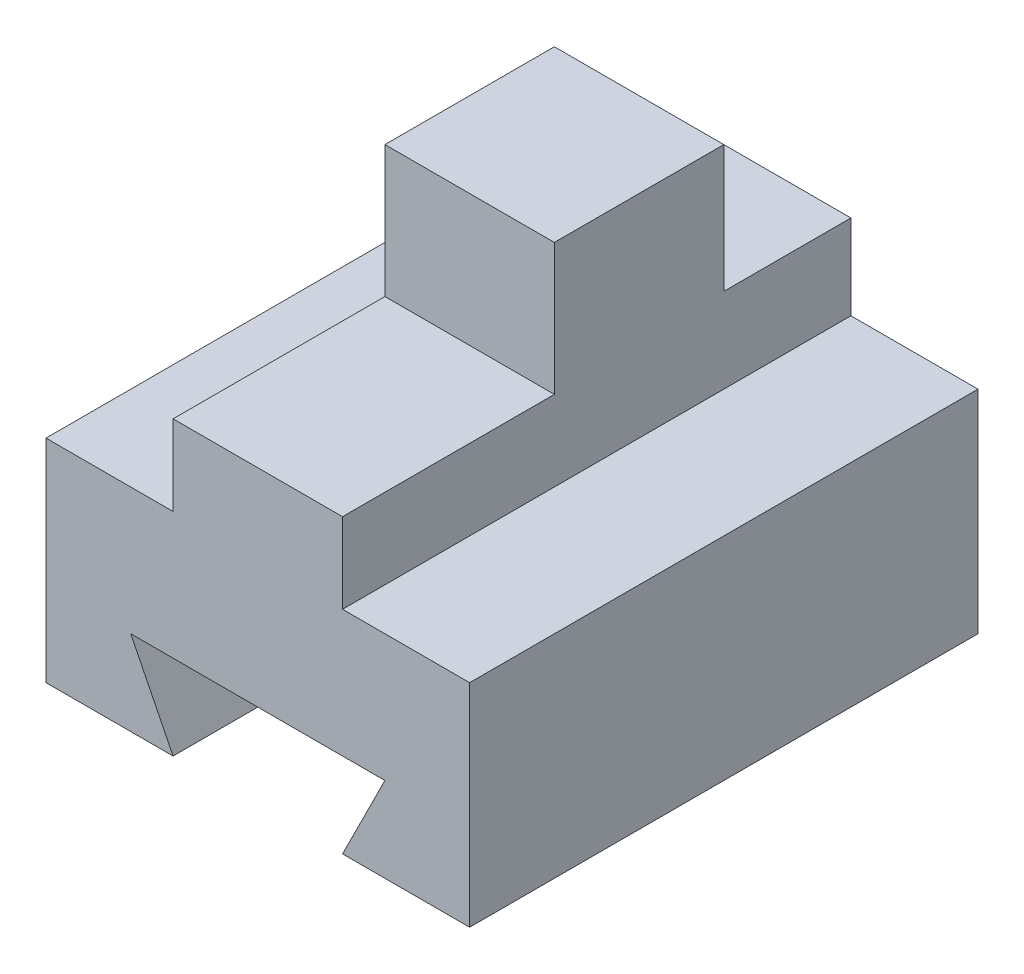
ISO-10303-21;
HEADER;
FILE_DESCRIPTION(('STEP AP214'),'2;1');
FILE_NAME('part.step','',(''),(''),'','','');
FILE_SCHEMA(('AUTOMOTIVE_DESIGN { 1 0 10303 214 1 1 1 1 }'));
ENDSEC;
DATA;
#1=APPLICATION_CONTEXT('core data for automotive mechanical design processes');
#2=APPLICATION_PROTOCOL_DEFINITION('international standard','automotive_design',2000,#1);
#3=PRODUCT_CONTEXT('',#1,'mechanical');
#4=PRODUCT('Part','Part','',(#3));
#5=PRODUCT_RELATED_PRODUCT_CATEGORY('part','',(#4));
#6=PRODUCT_DEFINITION_FORMATION('','',#4);
#7=PRODUCT_DEFINITION_CONTEXT('part definition',#1,'design');
#8=PRODUCT_DEFINITION('design','',#6,#7);
#9=PRODUCT_DEFINITION_SHAPE('','',#8);
#10=(LENGTH_UNIT() NAMED_UNIT(*) SI_UNIT(.MILLI.,.METRE.));
#11=(NAMED_UNIT(*) PLANE_ANGLE_UNIT() SI_UNIT($,.RADIAN.));
#12=(NAMED_UNIT(*) SI_UNIT($,.STERADIAN.) SOLID_ANGLE_UNIT());
#13=UNCERTAINTY_MEASURE_WITH_UNIT(LENGTH_MEASURE(1.E-05),#10,'distance_accuracy_value','');
#14=(GEOMETRIC_REPRESENTATION_CONTEXT(3) GLOBAL_UNCERTAINTY_ASSIGNED_CONTEXT((#13)) GLOBAL_UNIT_ASSIGNED_CONTEXT((#10,
#11,#12)) REPRESENTATION_CONTEXT('',''));
#15=CARTESIAN_POINT('',(0.,0.,0.));
#16=DIRECTION('',(0.,0.,1.));
#17=DIRECTION('',(1.,0.,0.));
#18=AXIS2_PLACEMENT_3D('',#15,#16,#17);
#19=CARTESIAN_POINT('',(-38.1029706753271,-27.6315789473684,60.));
#20=DIRECTION('',(0.,1.,0.));
#21=DIRECTION('',(0.,0.,1.));
#22=AXIS2_PLACEMENT_3D('',#19,#20,#21);
#23=PLANE('',#22);
#24=DIRECTION('',(1.,0.,0.));
#25=VECTOR('',#24,1.);
#26=CARTESIAN_POINT('',(-38.1029706753271,-27.6315789473684,0.));
#27=LINE('',#26,#25);
#28=CARTESIAN_POINT('',(-38.1029706753271,-27.6315789473684,0.));
#29=VERTEX_POINT('',#28);
#30=CARTESIAN_POINT('',(-23.1029706753271,-27.6315789473684,0.));
#31=VERTEX_POINT('',#30);
#32=EDGE_CURVE('E220',#29,#31,#27,.T.);
#33=ORIENTED_EDGE('',*,*,#32,.T.);
#34=DIRECTION('',(0.,0.,1.));
#35=VECTOR('',#34,1.);
#36=CARTESIAN_POINT('',(-23.1029706753271,-27.6315789473684,0.));
#37=LINE('',#36,#35);
#38=CARTESIAN_POINT('',(-23.1029706753271,-27.6315789473684,60.));
#39=VERTEX_POINT('',#38);
#40=EDGE_CURVE('E191',#31,#39,#37,.T.);
#41=ORIENTED_EDGE('',*,*,#40,.T.);
#42=DIRECTION('',(1.,0.,0.));
#43=VECTOR('',#42,1.);
#44=CARTESIAN_POINT('',(-38.1029706753271,-27.6315789473684,60.));
#45=LINE('',#44,#43);
#46=CARTESIAN_POINT('',(-38.1029706753271,-27.6315789473684,60.));
#47=VERTEX_POINT('',#46);
#48=EDGE_CURVE('E212',#47,#39,#45,.T.);
#49=ORIENTED_EDGE('',*,*,#48,.F.);
#50=DIRECTION('',(0.,0.,-1.));
#51=VECTOR('',#50,1.);
#52=CARTESIAN_POINT('',(-38.1029706753271,-27.6315789473684,60.));
#53=LINE('',#52,#51);
#54=EDGE_CURVE('E11',#47,#29,#53,.T.);
#55=ORIENTED_EDGE('',*,*,#54,.T.);
#56=EDGE_LOOP('',(#33,#41,#49,#55));
#57=FACE_BOUND('',#56,.T.);
#58=ADVANCED_FACE('F33',(#57),#23,.F.);
#59=CARTESIAN_POINT('',(-38.1029706753271,22.3684210526316,60.));
#60=DIRECTION('',(1.,0.,0.));
#61=DIRECTION('',(0.,0.,-1.));
#62=AXIS2_PLACEMENT_3D('',#59,#60,#61);
#63=PLANE('',#62);
#64=DIRECTION('',(0.,-1.,0.));
#65=VECTOR('',#64,1.);
#66=CARTESIAN_POINT('',(-38.1029706753271,22.3684210526316,60.));
#67=LINE('',#66,#65);
#68=CARTESIAN_POINT('',(-38.1029706753271,-2.63157894736843,60.));
#69=VERTEX_POINT('',#68);
#70=EDGE_CURVE('E208',#69,#47,#67,.T.);
#71=ORIENTED_EDGE('',*,*,#70,.F.);
#72=DIRECTION('',(0.,0.,1.));
#73=VECTOR('',#72,1.);
#74=CARTESIAN_POINT('',(-38.1029706753271,-2.63157894736843,0.));
#75=LINE('',#74,#73);
#76=CARTESIAN_POINT('',(-38.1029706753271,-2.63157894736843,0.));
#77=VERTEX_POINT('',#76);
#78=EDGE_CURVE('E278',#77,#69,#75,.T.);
#79=ORIENTED_EDGE('',*,*,#78,.F.);
#80=DIRECTION('',(0.,-1.,0.));
#81=VECTOR('',#80,1.);
#82=CARTESIAN_POINT('',(-38.1029706753271,22.3684210526316,0.));
#83=LINE('',#82,#81);
#84=EDGE_CURVE('E201',#77,#29,#83,.T.);
#85=ORIENTED_EDGE('',*,*,#84,.T.);
#86=ORIENTED_EDGE('',*,*,#54,.F.);
#87=EDGE_LOOP('',(#71,#79,#85,#86));
#88=FACE_BOUND('',#87,.T.);
#89=ADVANCED_FACE('F35',(#88),#63,.F.);
#90=CARTESIAN_POINT('',(-3.10297067532714,-27.6315789473684,60.));
#91=VERTEX_POINT('',#90);
#92=CARTESIAN_POINT('',(11.8970293246729,-27.6315789473684,60.));
#93=VERTEX_POINT('',#92);
#94=EDGE_CURVE('E210',#91,#93,#45,.T.);
#95=ORIENTED_EDGE('',*,*,#94,.F.);
#96=DIRECTION('',(0.,0.,1.));
#97=VECTOR('',#96,1.);
#98=CARTESIAN_POINT('',(-3.10297067532714,-27.6315789473684,0.));
#99=LINE('',#98,#97);
#100=CARTESIAN_POINT('',(-3.10297067532714,-27.6315789473684,0.));
#101=VERTEX_POINT('',#100);
#102=EDGE_CURVE('E204',#101,#91,#99,.T.);
#103=ORIENTED_EDGE('',*,*,#102,.F.);
#104=CARTESIAN_POINT('',(11.8970293246729,-27.6315789473684,0.));
#105=VERTEX_POINT('',#104);
#106=EDGE_CURVE('E219',#101,#105,#27,.T.);
#107=ORIENTED_EDGE('',*,*,#106,.T.);
#108=DIRECTION('',(0.,0.,-1.));
#109=VECTOR('',#108,1.);
#110=CARTESIAN_POINT('',(11.8970293246729,-27.6315789473684,60.));
#111=LINE('',#110,#109);
#112=EDGE_CURVE('E41',#93,#105,#111,.T.);
#113=ORIENTED_EDGE('',*,*,#112,.F.);
#114=EDGE_LOOP('',(#95,#103,#107,#113));
#115=FACE_BOUND('',#114,.T.);
#116=ADVANCED_FACE('F257',(#115),#23,.F.);
#117=CARTESIAN_POINT('',(11.8970293246729,22.3684210526316,60.));
#118=DIRECTION('',(-1.,0.,0.));
#119=DIRECTION('',(0.,0.,1.));
#120=AXIS2_PLACEMENT_3D('',#117,#118,#119);
#121=PLANE('',#120);
#122=DIRECTION('',(0.,1.,0.));
#123=VECTOR('',#122,1.);
#124=CARTESIAN_POINT('',(11.8970293246729,22.3684210526316,0.));
#125=LINE('',#124,#123);
#126=CARTESIAN_POINT('',(11.8970293246729,-2.63157894736843,0.));
#127=VERTEX_POINT('',#126);
#128=EDGE_CURVE('E211',#105,#127,#125,.T.);
#129=ORIENTED_EDGE('',*,*,#128,.T.);
#130=DIRECTION('',(0.,0.,1.));
#131=VECTOR('',#130,1.);
#132=CARTESIAN_POINT('',(11.8970293246729,-2.63157894736843,0.));
#133=LINE('',#132,#131);
#134=CARTESIAN_POINT('',(11.8970293246729,-2.63157894736843,60.));
#135=VERTEX_POINT('',#134);
#136=EDGE_CURVE('E174',#127,#135,#133,.T.);
#137=ORIENTED_EDGE('',*,*,#136,.T.);
#138=DIRECTION('',(0.,1.,0.));
#139=VECTOR('',#138,1.);
#140=CARTESIAN_POINT('',(11.8970293246729,22.3684210526316,60.));
#141=LINE('',#140,#139);
#142=EDGE_CURVE('E215',#93,#135,#141,.T.);
#143=ORIENTED_EDGE('',*,*,#142,.F.);
#144=ORIENTED_EDGE('',*,*,#112,.T.);
#145=EDGE_LOOP('',(#129,#137,#143,#144));
#146=FACE_BOUND('',#145,.T.);
#147=ADVANCED_FACE('F229',(#146),#121,.F.);
#148=CARTESIAN_POINT('',(-38.1029706753271,22.3684210526316,60.));
#149=DIRECTION('',(0.,-1.,0.));
#150=DIRECTION('',(1.,0.,0.));
#151=AXIS2_PLACEMENT_3D('',#148,#149,#150);
#152=PLANE('',#151);
#153=DIRECTION('',(0.,0.,1.));
#154=VECTOR('',#153,1.);
#155=CARTESIAN_POINT('',(-23.1029706753271,22.3684210526316,0.));
#156=LINE('',#155,#154);
#157=CARTESIAN_POINT('',(-23.1029706753271,22.3684210526316,15.));
#158=VERTEX_POINT('',#157);
#159=CARTESIAN_POINT('',(-23.1029706753271,22.3684210526316,35.));
#160=VERTEX_POINT('',#159);
#161=EDGE_CURVE('E163',#158,#160,#156,.T.);
#162=ORIENTED_EDGE('',*,*,#161,.T.);
#163=DIRECTION('',(-1.,0.,0.));
#164=VECTOR('',#163,1.);
#165=CARTESIAN_POINT('',(-3.10297067532715,22.3684210526316,35.));
#166=LINE('',#165,#164);
#167=CARTESIAN_POINT('',(-3.10297067532715,22.3684210526316,35.));
#168=VERTEX_POINT('',#167);
#169=EDGE_CURVE('E48',#168,#160,#166,.T.);
#170=ORIENTED_EDGE('',*,*,#169,.F.);
#171=DIRECTION('',(0.,0.,1.));
#172=VECTOR('',#171,1.);
#173=CARTESIAN_POINT('',(-3.10297067532714,22.3684210526316,0.));
#174=LINE('',#173,#172);
#175=CARTESIAN_POINT('',(-3.10297067532715,22.3684210526316,15.));
#176=VERTEX_POINT('',#175);
#177=EDGE_CURVE('E161',#176,#168,#174,.T.);
#178=ORIENTED_EDGE('',*,*,#177,.F.);
#179=DIRECTION('',(-1.,0.,0.));
#180=VECTOR('',#179,1.);
#181=CARTESIAN_POINT('',(-3.10297067532715,22.3684210526316,15.));
#182=LINE('',#181,#180);
#183=EDGE_CURVE('E293',#176,#158,#182,.T.);
#184=ORIENTED_EDGE('',*,*,#183,.T.);
#185=EDGE_LOOP('',(#162,#170,#178,#184));
#186=FACE_BOUND('',#185,.T.);
#187=ADVANCED_FACE('F159',(#186),#152,.F.);
#188=CARTESIAN_POINT('',(0.,0.,60.));
#189=DIRECTION('',(0.,0.,1.));
#190=DIRECTION('',(1.,0.,0.));
#191=AXIS2_PLACEMENT_3D('',#188,#189,#190);
#192=PLANE('',#191);
#193=DIRECTION('',(-1.,0.,0.));
#194=VECTOR('',#193,1.);
#195=CARTESIAN_POINT('',(-3.10297067532715,6.83636319229313,60.));
#196=LINE('',#195,#194);
#197=CARTESIAN_POINT('',(-3.10297067532715,6.83636319229313,60.));
#198=VERTEX_POINT('',#197);
#199=CARTESIAN_POINT('',(-23.1029706753271,6.83636319229313,60.));
#200=VERTEX_POINT('',#199);
#201=EDGE_CURVE('E297',#198,#200,#196,.T.);
#202=ORIENTED_EDGE('',*,*,#201,.T.);
#203=DIRECTION('',(0.,1.,0.));
#204=VECTOR('',#203,1.);
#205=CARTESIAN_POINT('',(-23.1029706753271,-2.63157894736843,60.));
#206=LINE('',#205,#204);
#207=CARTESIAN_POINT('',(-23.1029706753271,-2.63157894736843,60.));
#208=VERTEX_POINT('',#207);
#209=EDGE_CURVE('E285',#208,#200,#206,.T.);
#210=ORIENTED_EDGE('',*,*,#209,.F.);
#211=DIRECTION('',(1.,0.,0.));
#212=VECTOR('',#211,1.);
#213=CARTESIAN_POINT('',(-38.1029706753271,-2.63157894736843,60.));
#214=LINE('',#213,#212);
#215=EDGE_CURVE('E275',#69,#208,#214,.T.);
#216=ORIENTED_EDGE('',*,*,#215,.F.);
#217=ORIENTED_EDGE('',*,*,#70,.T.);
#218=ORIENTED_EDGE('',*,*,#48,.T.);
#219=DIRECTION('',(0.447213595499958,-0.894427190999916,0.));
#220=VECTOR('',#219,1.);
#221=CARTESIAN_POINT('',(-23.1029706753271,-27.6315789473684,60.));
#222=LINE('',#221,#220);
#223=CARTESIAN_POINT('',(-28.1029706753271,-17.6315789473684,60.));
#224=VERTEX_POINT('',#223);
#225=EDGE_CURVE('E192',#224,#39,#222,.T.);
#226=ORIENTED_EDGE('',*,*,#225,.F.);
#227=DIRECTION('',(-1.,0.,0.));
#228=VECTOR('',#227,1.);
#229=CARTESIAN_POINT('',(-28.1029706753271,-17.6315789473684,60.));
#230=LINE('',#229,#228);
#231=CARTESIAN_POINT('',(1.89702932467285,-17.6315789473684,60.));
#232=VERTEX_POINT('',#231);
#233=EDGE_CURVE('E185',#232,#224,#230,.T.);
#234=ORIENTED_EDGE('',*,*,#233,.F.);
#235=DIRECTION('',(0.447213595499958,0.894427190999916,0.));
#236=VECTOR('',#235,1.);
#237=CARTESIAN_POINT('',(1.89702932467285,-17.6315789473684,60.));
#238=LINE('',#237,#236);
#239=EDGE_CURVE('E194',#91,#232,#238,.T.);
#240=ORIENTED_EDGE('',*,*,#239,.F.);
#241=ORIENTED_EDGE('',*,*,#94,.T.);
#242=ORIENTED_EDGE('',*,*,#142,.T.);
#243=DIRECTION('',(1.,0.,0.));
#244=VECTOR('',#243,1.);
#245=CARTESIAN_POINT('',(11.8970293246729,-2.63157894736843,60.));
#246=LINE('',#245,#244);
#247=CARTESIAN_POINT('',(-3.10297067532714,-2.63157894736843,60.));
#248=VERTEX_POINT('',#247);
#249=EDGE_CURVE('E247',#248,#135,#246,.T.);
#250=ORIENTED_EDGE('',*,*,#249,.F.);
#251=DIRECTION('',(0.,-1.,0.));
#252=VECTOR('',#251,1.);
#253=CARTESIAN_POINT('',(-3.10297067532714,-2.63157894736843,60.));
#254=LINE('',#253,#252);
#255=EDGE_CURVE('E244',#198,#248,#254,.T.);
#256=ORIENTED_EDGE('',*,*,#255,.F.);
#257=EDGE_LOOP('',(#202,#210,#216,#217,#218,#226,#234,#240,#241,#242,#250,#256));
#258=FACE_BOUND('',#257,.T.);
#259=ADVANCED_FACE('F253',(#258),#192,.T.);
#260=CARTESIAN_POINT('',(0.,0.,0.));
#261=DIRECTION('',(0.,0.,1.));
#262=DIRECTION('',(1.,0.,0.));
#263=AXIS2_PLACEMENT_3D('',#260,#261,#262);
#264=PLANE('',#263);
#265=DIRECTION('',(0.,1.,0.));
#266=VECTOR('',#265,1.);
#267=CARTESIAN_POINT('',(-23.1029706753271,-2.63157894736843,0.));
#268=LINE('',#267,#266);
#269=CARTESIAN_POINT('',(-23.1029706753271,-2.63157894736843,0.));
#270=VERTEX_POINT('',#269);
#271=CARTESIAN_POINT('',(-23.1029706753271,7.36842105263157,0.));
#272=VERTEX_POINT('',#271);
#273=EDGE_CURVE('E282',#270,#272,#268,.T.);
#274=ORIENTED_EDGE('',*,*,#273,.T.);
#275=DIRECTION('',(-1.,0.,0.));
#276=VECTOR('',#275,1.);
#277=CARTESIAN_POINT('',(-3.10297067532715,7.36842105263157,0.));
#278=LINE('',#277,#276);
#279=CARTESIAN_POINT('',(-3.10297067532715,7.36842105263157,0.));
#280=VERTEX_POINT('',#279);
#281=EDGE_CURVE('E56',#280,#272,#278,.T.);
#282=ORIENTED_EDGE('',*,*,#281,.F.);
#283=DIRECTION('',(0.,-1.,0.));
#284=VECTOR('',#283,1.);
#285=CARTESIAN_POINT('',(-3.10297067532714,-2.63157894736843,0.));
#286=LINE('',#285,#284);
#287=CARTESIAN_POINT('',(-3.10297067532714,-2.63157894736843,0.));
#288=VERTEX_POINT('',#287);
#289=EDGE_CURVE('E177',#280,#288,#286,.T.);
#290=ORIENTED_EDGE('',*,*,#289,.T.);
#291=DIRECTION('',(1.,0.,0.));
#292=VECTOR('',#291,1.);
#293=CARTESIAN_POINT('',(11.8970293246729,-2.63157894736843,0.));
#294=LINE('',#293,#292);
#295=EDGE_CURVE('E171',#288,#127,#294,.T.);
#296=ORIENTED_EDGE('',*,*,#295,.T.);
#297=ORIENTED_EDGE('',*,*,#128,.F.);
#298=ORIENTED_EDGE('',*,*,#106,.F.);
#299=DIRECTION('',(0.447213595499958,0.894427190999916,0.));
#300=VECTOR('',#299,1.);
#301=CARTESIAN_POINT('',(1.89702932467285,-17.6315789473684,0.));
#302=LINE('',#301,#300);
#303=CARTESIAN_POINT('',(1.89702932467285,-17.6315789473684,0.));
#304=VERTEX_POINT('',#303);
#305=EDGE_CURVE('E184',#101,#304,#302,.T.);
#306=ORIENTED_EDGE('',*,*,#305,.T.);
#307=DIRECTION('',(-1.,0.,0.));
#308=VECTOR('',#307,1.);
#309=CARTESIAN_POINT('',(-28.1029706753271,-17.6315789473684,0.));
#310=LINE('',#309,#308);
#311=CARTESIAN_POINT('',(-28.1029706753271,-17.6315789473684,0.));
#312=VERTEX_POINT('',#311);
#313=EDGE_CURVE('E188',#304,#312,#310,.T.);
#314=ORIENTED_EDGE('',*,*,#313,.T.);
#315=DIRECTION('',(0.447213595499958,-0.894427190999916,0.));
#316=VECTOR('',#315,1.);
#317=CARTESIAN_POINT('',(-23.1029706753271,-27.6315789473684,0.));
#318=LINE('',#317,#316);
#319=EDGE_CURVE('E181',#312,#31,#318,.T.);
#320=ORIENTED_EDGE('',*,*,#319,.T.);
#321=ORIENTED_EDGE('',*,*,#32,.F.);
#322=ORIENTED_EDGE('',*,*,#84,.F.);
#323=DIRECTION('',(1.,0.,0.));
#324=VECTOR('',#323,1.);
#325=CARTESIAN_POINT('',(-38.1029706753271,-2.63157894736843,0.));
#326=LINE('',#325,#324);
#327=EDGE_CURVE('E281',#77,#270,#326,.T.);
#328=ORIENTED_EDGE('',*,*,#327,.T.);
#329=EDGE_LOOP('',(#274,#282,#290,#296,#297,#298,#306,#314,#320,#321,#322,#328));
#330=FACE_BOUND('',#329,.T.);
#331=ADVANCED_FACE('F236',(#330),#264,.F.);
#332=CARTESIAN_POINT('',(-23.1029706753271,-27.6315789473684,0.));
#333=DIRECTION('',(-0.894427190999916,-0.447213595499958,0.));
#334=DIRECTION('',(0.447213595499958,-0.894427190999916,0.));
#335=AXIS2_PLACEMENT_3D('',#332,#333,#334);
#336=PLANE('',#335);
#337=ORIENTED_EDGE('',*,*,#225,.T.);
#338=ORIENTED_EDGE('',*,*,#40,.F.);
#339=ORIENTED_EDGE('',*,*,#319,.F.);
#340=DIRECTION('',(0.,0.,1.));
#341=VECTOR('',#340,1.);
#342=CARTESIAN_POINT('',(-28.1029706753271,-17.6315789473684,0.));
#343=LINE('',#342,#341);
#344=EDGE_CURVE('E199',#312,#224,#343,.T.);
#345=ORIENTED_EDGE('',*,*,#344,.T.);
#346=EDGE_LOOP('',(#337,#338,#339,#345));
#347=FACE_BOUND('',#346,.T.);
#348=ADVANCED_FACE('F267',(#347),#336,.F.);
#349=CARTESIAN_POINT('',(-28.1029706753271,-17.6315789473684,0.));
#350=DIRECTION('',(0.,1.,0.));
#351=DIRECTION('',(0.,0.,1.));
#352=AXIS2_PLACEMENT_3D('',#349,#350,#351);
#353=PLANE('',#352);
#354=ORIENTED_EDGE('',*,*,#233,.T.);
#355=ORIENTED_EDGE('',*,*,#344,.F.);
#356=ORIENTED_EDGE('',*,*,#313,.F.);
#357=DIRECTION('',(0.,0.,1.));
#358=VECTOR('',#357,1.);
#359=CARTESIAN_POINT('',(1.89702932467285,-17.6315789473684,0.));
#360=LINE('',#359,#358);
#361=EDGE_CURVE('E202',#304,#232,#360,.T.);
#362=ORIENTED_EDGE('',*,*,#361,.T.);
#363=EDGE_LOOP('',(#354,#355,#356,#362));
#364=FACE_BOUND('',#363,.T.);
#365=ADVANCED_FACE('F264',(#364),#353,.F.);
#366=CARTESIAN_POINT('',(1.89702932467285,-17.6315789473684,0.));
#367=DIRECTION('',(0.894427190999916,-0.447213595499958,0.));
#368=DIRECTION('',(0.447213595499958,0.894427190999916,0.));
#369=AXIS2_PLACEMENT_3D('',#366,#367,#368);
#370=PLANE('',#369);
#371=ORIENTED_EDGE('',*,*,#239,.T.);
#372=ORIENTED_EDGE('',*,*,#361,.F.);
#373=ORIENTED_EDGE('',*,*,#305,.F.);
#374=ORIENTED_EDGE('',*,*,#102,.T.);
#375=EDGE_LOOP('',(#371,#372,#373,#374));
#376=FACE_BOUND('',#375,.T.);
#377=ADVANCED_FACE('F259',(#376),#370,.F.);
#378=CARTESIAN_POINT('',(11.8970293246729,-2.63157894736843,0.));
#379=DIRECTION('',(0.,-1.,0.));
#380=DIRECTION('',(1.,0.,0.));
#381=AXIS2_PLACEMENT_3D('',#378,#379,#380);
#382=PLANE('',#381);
#383=ORIENTED_EDGE('',*,*,#249,.T.);
#384=ORIENTED_EDGE('',*,*,#136,.F.);
#385=ORIENTED_EDGE('',*,*,#295,.F.);
#386=DIRECTION('',(0.,0.,1.));
#387=VECTOR('',#386,1.);
#388=CARTESIAN_POINT('',(-3.10297067532714,-2.63157894736843,0.));
#389=LINE('',#388,#387);
#390=EDGE_CURVE('E170',#288,#248,#389,.T.);
#391=ORIENTED_EDGE('',*,*,#390,.T.);
#392=EDGE_LOOP('',(#383,#384,#385,#391));
#393=FACE_BOUND('',#392,.T.);
#394=ADVANCED_FACE('F241',(#393),#382,.F.);
#395=CARTESIAN_POINT('',(-3.10297067532714,-2.63157894736843,0.));
#396=DIRECTION('',(-1.,0.,0.));
#397=DIRECTION('',(0.,0.,1.));
#398=AXIS2_PLACEMENT_3D('',#395,#396,#397);
#399=PLANE('',#398);
#400=DIRECTION('',(0.,-1.,0.));
#401=VECTOR('',#400,1.);
#402=CARTESIAN_POINT('',(-3.10297067532715,22.3684210526316,35.));
#403=LINE('',#402,#401);
#404=CARTESIAN_POINT('',(-3.10297067532715,6.83636319229313,35.));
#405=VERTEX_POINT('',#404);
#406=EDGE_CURVE('E146',#168,#405,#403,.T.);
#407=ORIENTED_EDGE('',*,*,#406,.T.);
#408=DIRECTION('',(0.,0.,1.));
#409=VECTOR('',#408,1.);
#410=CARTESIAN_POINT('',(-3.10297067532715,6.83636319229313,35.));
#411=LINE('',#410,#409);
#412=EDGE_CURVE('E153',#405,#198,#411,.T.);
#413=ORIENTED_EDGE('',*,*,#412,.T.);
#414=ORIENTED_EDGE('',*,*,#255,.T.);
#415=ORIENTED_EDGE('',*,*,#390,.F.);
#416=ORIENTED_EDGE('',*,*,#289,.F.);
#417=DIRECTION('',(0.,0.,1.));
#418=VECTOR('',#417,1.);
#419=CARTESIAN_POINT('',(-3.10297067532715,7.36842105263157,0.));
#420=LINE('',#419,#418);
#421=CARTESIAN_POINT('',(-3.10297067532715,7.36842105263157,15.));
#422=VERTEX_POINT('',#421);
#423=EDGE_CURVE('E305',#280,#422,#420,.T.);
#424=ORIENTED_EDGE('',*,*,#423,.T.);
#425=DIRECTION('',(0.,1.,0.));
#426=VECTOR('',#425,1.);
#427=CARTESIAN_POINT('',(-3.10297067532715,7.36842105263157,15.));
#428=LINE('',#427,#426);
#429=EDGE_CURVE('E169',#422,#176,#428,.T.);
#430=ORIENTED_EDGE('',*,*,#429,.T.);
#431=ORIENTED_EDGE('',*,*,#177,.T.);
#432=EDGE_LOOP('',(#407,#413,#414,#415,#416,#424,#430,#431));
#433=FACE_BOUND('',#432,.T.);
#434=ADVANCED_FACE('F166',(#433),#399,.F.);
#435=CARTESIAN_POINT('',(-23.1029706753271,-2.63157894736843,0.));
#436=DIRECTION('',(1.,0.,0.));
#437=DIRECTION('',(0.,0.,-1.));
#438=AXIS2_PLACEMENT_3D('',#435,#436,#437);
#439=PLANE('',#438);
#440=ORIENTED_EDGE('',*,*,#209,.T.);
#441=DIRECTION('',(0.,0.,1.));
#442=VECTOR('',#441,1.);
#443=CARTESIAN_POINT('',(-23.1029706753271,6.83636319229313,35.));
#444=LINE('',#443,#442);
#445=CARTESIAN_POINT('',(-23.1029706753271,6.83636319229313,35.));
#446=VERTEX_POINT('',#445);
#447=EDGE_CURVE('E154',#446,#200,#444,.T.);
#448=ORIENTED_EDGE('',*,*,#447,.F.);
#449=DIRECTION('',(0.,-1.,0.));
#450=VECTOR('',#449,1.);
#451=CARTESIAN_POINT('',(-23.1029706753271,22.3684210526316,35.));
#452=LINE('',#451,#450);
#453=EDGE_CURVE('E316',#160,#446,#452,.T.);
#454=ORIENTED_EDGE('',*,*,#453,.F.);
#455=ORIENTED_EDGE('',*,*,#161,.F.);
#456=DIRECTION('',(0.,1.,0.));
#457=VECTOR('',#456,1.);
#458=CARTESIAN_POINT('',(-23.1029706753271,7.36842105263157,15.));
#459=LINE('',#458,#457);
#460=CARTESIAN_POINT('',(-23.1029706753271,7.36842105263157,15.));
#461=VERTEX_POINT('',#460);
#462=EDGE_CURVE('E303',#461,#158,#459,.T.);
#463=ORIENTED_EDGE('',*,*,#462,.F.);
#464=DIRECTION('',(0.,0.,1.));
#465=VECTOR('',#464,1.);
#466=CARTESIAN_POINT('',(-23.1029706753271,7.36842105263157,0.));
#467=LINE('',#466,#465);
#468=EDGE_CURVE('E302',#272,#461,#467,.T.);
#469=ORIENTED_EDGE('',*,*,#468,.F.);
#470=ORIENTED_EDGE('',*,*,#273,.F.);
#471=DIRECTION('',(0.,0.,1.));
#472=VECTOR('',#471,1.);
#473=CARTESIAN_POINT('',(-23.1029706753271,-2.63157894736843,0.));
#474=LINE('',#473,#472);
#475=EDGE_CURVE('E250',#270,#208,#474,.T.);
#476=ORIENTED_EDGE('',*,*,#475,.T.);
#477=EDGE_LOOP('',(#440,#448,#454,#455,#463,#469,#470,#476));
#478=FACE_BOUND('',#477,.T.);
#479=ADVANCED_FACE('F300',(#478),#439,.F.);
#480=CARTESIAN_POINT('',(-38.1029706753271,-2.63157894736843,0.));
#481=DIRECTION('',(0.,-1.,0.));
#482=DIRECTION('',(1.,0.,0.));
#483=AXIS2_PLACEMENT_3D('',#480,#481,#482);
#484=PLANE('',#483);
#485=ORIENTED_EDGE('',*,*,#215,.T.);
#486=ORIENTED_EDGE('',*,*,#475,.F.);
#487=ORIENTED_EDGE('',*,*,#327,.F.);
#488=ORIENTED_EDGE('',*,*,#78,.T.);
#489=EDGE_LOOP('',(#485,#486,#487,#488));
#490=FACE_BOUND('',#489,.T.);
#491=ADVANCED_FACE('F296',(#490),#484,.F.);
#492=CARTESIAN_POINT('',(-3.10297067532715,7.36842105263157,15.));
#493=DIRECTION('',(0.,0.,1.));
#494=DIRECTION('',(1.,0.,0.));
#495=AXIS2_PLACEMENT_3D('',#492,#493,#494);
#496=PLANE('',#495);
#497=ORIENTED_EDGE('',*,*,#462,.T.);
#498=ORIENTED_EDGE('',*,*,#183,.F.);
#499=ORIENTED_EDGE('',*,*,#429,.F.);
#500=DIRECTION('',(-1.,0.,0.));
#501=VECTOR('',#500,1.);
#502=CARTESIAN_POINT('',(-3.10297067532715,7.36842105263157,15.));
#503=LINE('',#502,#501);
#504=EDGE_CURVE('E311',#422,#461,#503,.T.);
#505=ORIENTED_EDGE('',*,*,#504,.T.);
#506=EDGE_LOOP('',(#497,#498,#499,#505));
#507=FACE_BOUND('',#506,.T.);
#508=ADVANCED_FACE('F328',(#507),#496,.F.);
#509=CARTESIAN_POINT('',(-3.10297067532715,7.36842105263157,0.));
#510=DIRECTION('',(0.,-1.,0.));
#511=DIRECTION('',(0.,0.,-1.));
#512=AXIS2_PLACEMENT_3D('',#509,#510,#511);
#513=PLANE('',#512);
#514=ORIENTED_EDGE('',*,*,#468,.T.);
#515=ORIENTED_EDGE('',*,*,#504,.F.);
#516=ORIENTED_EDGE('',*,*,#423,.F.);
#517=ORIENTED_EDGE('',*,*,#281,.T.);
#518=EDGE_LOOP('',(#514,#515,#516,#517));
#519=FACE_BOUND('',#518,.T.);
#520=ADVANCED_FACE('F321',(#519),#513,.F.);
#521=CARTESIAN_POINT('',(-3.10297067532715,6.83636319229313,35.));
#522=DIRECTION('',(0.,-1.,0.));
#523=DIRECTION('',(0.,0.,-1.));
#524=AXIS2_PLACEMENT_3D('',#521,#522,#523);
#525=PLANE('',#524);
#526=ORIENTED_EDGE('',*,*,#447,.T.);
#527=ORIENTED_EDGE('',*,*,#201,.F.);
#528=ORIENTED_EDGE('',*,*,#412,.F.);
#529=DIRECTION('',(-1.,0.,0.));
#530=VECTOR('',#529,1.);
#531=CARTESIAN_POINT('',(-3.10297067532715,6.83636319229313,35.));
#532=LINE('',#531,#530);
#533=EDGE_CURVE('E148',#405,#446,#532,.T.);
#534=ORIENTED_EDGE('',*,*,#533,.T.);
#535=EDGE_LOOP('',(#526,#527,#528,#534));
#536=FACE_BOUND('',#535,.T.);
#537=ADVANCED_FACE('F319',(#536),#525,.F.);
#538=CARTESIAN_POINT('',(-3.10297067532715,22.3684210526316,35.));
#539=DIRECTION('',(0.,0.,-1.));
#540=DIRECTION('',(-1.,0.,0.));
#541=AXIS2_PLACEMENT_3D('',#538,#539,#540);
#542=PLANE('',#541);
#543=ORIENTED_EDGE('',*,*,#453,.T.);
#544=ORIENTED_EDGE('',*,*,#533,.F.);
#545=ORIENTED_EDGE('',*,*,#406,.F.);
#546=ORIENTED_EDGE('',*,*,#169,.T.);
#547=EDGE_LOOP('',(#543,#544,#545,#546));
#548=FACE_BOUND('',#547,.T.);
#549=ADVANCED_FACE('F147',(#548),#542,.F.);
#550=CLOSED_SHELL('',(#58,#89,#116,#147,#187,#259,#331,#348,#365,#377,#394,#434,#479,#491,#508,
#520,#537,#549));
#551=MANIFOLD_SOLID_BREP('B2',#550);
#552=ADVANCED_BREP_SHAPE_REPRESENTATION('',(#18,#551),#14);
#553=SHAPE_DEFINITION_REPRESENTATION(#9,#552);
ENDSEC;
END-ISO-10303-21;
